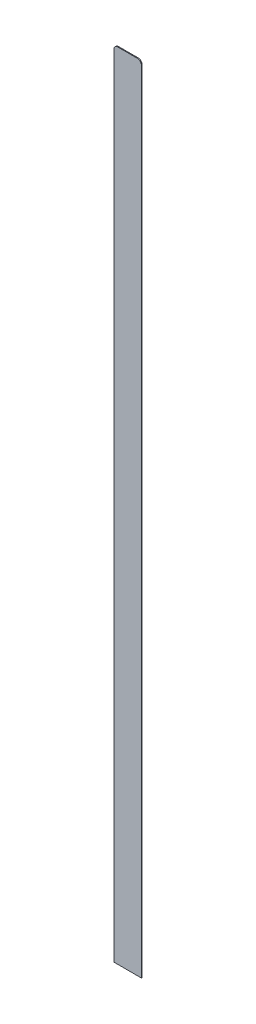
ISO-10303-21;
HEADER;
FILE_DESCRIPTION(('STEP AP214'),'2;1');
FILE_NAME('part.step','',(''),(''),'','','');
FILE_SCHEMA(('AUTOMOTIVE_DESIGN { 1 0 10303 214 1 1 1 1 }'));
ENDSEC;
DATA;
#1=APPLICATION_CONTEXT('core data for automotive mechanical design processes');
#2=APPLICATION_PROTOCOL_DEFINITION('international standard','automotive_design',2000,#1);
#3=PRODUCT_CONTEXT('',#1,'mechanical');
#4=PRODUCT('Part','Part','',(#3));
#5=PRODUCT_RELATED_PRODUCT_CATEGORY('part','',(#4));
#6=PRODUCT_DEFINITION_FORMATION('','',#4);
#7=PRODUCT_DEFINITION_CONTEXT('part definition',#1,'design');
#8=PRODUCT_DEFINITION('design','',#6,#7);
#9=PRODUCT_DEFINITION_SHAPE('','',#8);
#10=(LENGTH_UNIT() NAMED_UNIT(*) SI_UNIT(.MILLI.,.METRE.));
#11=(NAMED_UNIT(*) PLANE_ANGLE_UNIT() SI_UNIT($,.RADIAN.));
#12=(NAMED_UNIT(*) SI_UNIT($,.STERADIAN.) SOLID_ANGLE_UNIT());
#13=UNCERTAINTY_MEASURE_WITH_UNIT(LENGTH_MEASURE(1.E-05),#10,'distance_accuracy_value','');
#14=(GEOMETRIC_REPRESENTATION_CONTEXT(3) GLOBAL_UNCERTAINTY_ASSIGNED_CONTEXT((#13)) GLOBAL_UNIT_ASSIGNED_CONTEXT((#10,
#11,#12)) REPRESENTATION_CONTEXT('',''));
#15=CARTESIAN_POINT('',(0.,0.,0.));
#16=DIRECTION('',(0.,0.,1.));
#17=DIRECTION('',(1.,0.,0.));
#18=AXIS2_PLACEMENT_3D('',#15,#16,#17);
#19=CARTESIAN_POINT('',(0.,0.,1.));
#20=DIRECTION('',(1.,0.,0.));
#21=DIRECTION('',(0.,0.,-1.));
#22=AXIS2_PLACEMENT_3D('',#19,#20,#21);
#23=PLANE('',#22);
#24=DIRECTION('',(0.,-1.,0.));
#25=VECTOR('',#24,1.);
#26=CARTESIAN_POINT('',(0.,0.,1.));
#27=LINE('',#26,#25);
#28=CARTESIAN_POINT('',(0.,1005.,1.));
#29=VERTEX_POINT('',#28);
#30=CARTESIAN_POINT('',(0.,0.,1.));
#31=VERTEX_POINT('',#30);
#32=EDGE_CURVE('E86',#29,#31,#27,.T.);
#33=ORIENTED_EDGE('',*,*,#32,.F.);
#34=DIRECTION('',(0.,0.,-1.));
#35=VECTOR('',#34,1.);
#36=CARTESIAN_POINT('',(0.,1005.,1.));
#37=LINE('',#36,#35);
#38=CARTESIAN_POINT('',(0.,1005.,0.));
#39=VERTEX_POINT('',#38);
#40=EDGE_CURVE('E11',#29,#39,#37,.T.);
#41=ORIENTED_EDGE('',*,*,#40,.T.);
#42=DIRECTION('',(0.,-1.,0.));
#43=VECTOR('',#42,1.);
#44=CARTESIAN_POINT('',(0.,0.,0.));
#45=LINE('',#44,#43);
#46=CARTESIAN_POINT('',(0.,0.,0.));
#47=VERTEX_POINT('',#46);
#48=EDGE_CURVE('E105',#39,#47,#45,.T.);
#49=ORIENTED_EDGE('',*,*,#48,.T.);
#50=DIRECTION('',(0.,0.,-1.));
#51=VECTOR('',#50,1.);
#52=CARTESIAN_POINT('',(0.,0.,1.));
#53=LINE('',#52,#51);
#54=EDGE_CURVE('E99',#31,#47,#53,.T.);
#55=ORIENTED_EDGE('',*,*,#54,.F.);
#56=EDGE_LOOP('',(#33,#41,#49,#55));
#57=FACE_BOUND('',#56,.T.);
#58=ADVANCED_FACE('F33',(#57),#23,.F.);
#59=CARTESIAN_POINT('',(0.,0.,1.));
#60=DIRECTION('',(0.,1.,0.));
#61=DIRECTION('',(0.,0.,1.));
#62=AXIS2_PLACEMENT_3D('',#59,#60,#61);
#63=PLANE('',#62);
#64=DIRECTION('',(1.,0.,0.));
#65=VECTOR('',#64,1.);
#66=CARTESIAN_POINT('',(0.,0.,0.));
#67=LINE('',#66,#65);
#68=CARTESIAN_POINT('',(35.,0.,0.));
#69=VERTEX_POINT('',#68);
#70=EDGE_CURVE('E138',#47,#69,#67,.T.);
#71=ORIENTED_EDGE('',*,*,#70,.T.);
#72=DIRECTION('',(0.,0.,-1.));
#73=VECTOR('',#72,1.);
#74=CARTESIAN_POINT('',(35.,0.,1.));
#75=LINE('',#74,#73);
#76=CARTESIAN_POINT('',(35.,0.,1.));
#77=VERTEX_POINT('',#76);
#78=EDGE_CURVE('E101',#77,#69,#75,.T.);
#79=ORIENTED_EDGE('',*,*,#78,.F.);
#80=DIRECTION('',(1.,0.,0.));
#81=VECTOR('',#80,1.);
#82=CARTESIAN_POINT('',(0.,0.,1.));
#83=LINE('',#82,#81);
#84=EDGE_CURVE('E89',#31,#77,#83,.T.);
#85=ORIENTED_EDGE('',*,*,#84,.F.);
#86=ORIENTED_EDGE('',*,*,#54,.T.);
#87=EDGE_LOOP('',(#71,#79,#85,#86));
#88=FACE_BOUND('',#87,.T.);
#89=ADVANCED_FACE('F98',(#88),#63,.F.);
#90=CARTESIAN_POINT('',(35.,0.,1.));
#91=DIRECTION('',(-1.,0.,0.));
#92=DIRECTION('',(0.,0.,1.));
#93=AXIS2_PLACEMENT_3D('',#90,#91,#92);
#94=PLANE('',#93);
#95=DIRECTION('',(0.,1.,0.));
#96=VECTOR('',#95,1.);
#97=CARTESIAN_POINT('',(35.,0.,0.));
#98=LINE('',#97,#96);
#99=CARTESIAN_POINT('',(35.,1005.,0.));
#100=VERTEX_POINT('',#99);
#101=EDGE_CURVE('E136',#69,#100,#98,.T.);
#102=ORIENTED_EDGE('',*,*,#101,.T.);
#103=DIRECTION('',(0.,0.,-1.));
#104=VECTOR('',#103,1.);
#105=CARTESIAN_POINT('',(35.,1005.,1.));
#106=LINE('',#105,#104);
#107=CARTESIAN_POINT('',(35.,1005.,1.));
#108=VERTEX_POINT('',#107);
#109=EDGE_CURVE('E56',#100,#108,#106,.F.);
#110=ORIENTED_EDGE('',*,*,#109,.T.);
#111=DIRECTION('',(0.,1.,0.));
#112=VECTOR('',#111,1.);
#113=CARTESIAN_POINT('',(35.,0.,1.));
#114=LINE('',#113,#112);
#115=EDGE_CURVE('E102',#77,#108,#114,.T.);
#116=ORIENTED_EDGE('',*,*,#115,.F.);
#117=ORIENTED_EDGE('',*,*,#78,.T.);
#118=EDGE_LOOP('',(#102,#110,#116,#117));
#119=FACE_BOUND('',#118,.T.);
#120=ADVANCED_FACE('F137',(#119),#94,.F.);
#121=CARTESIAN_POINT('',(0.,1010.,1.));
#122=DIRECTION('',(0.,-1.,0.));
#123=DIRECTION('',(0.,0.,-1.));
#124=AXIS2_PLACEMENT_3D('',#121,#122,#123);
#125=PLANE('',#124);
#126=DIRECTION('',(-1.,0.,0.));
#127=VECTOR('',#126,1.);
#128=CARTESIAN_POINT('',(0.,1010.,1.));
#129=LINE('',#128,#127);
#130=CARTESIAN_POINT('',(30.,1010.,1.));
#131=VERTEX_POINT('',#130);
#132=CARTESIAN_POINT('',(5.,1010.,1.));
#133=VERTEX_POINT('',#132);
#134=EDGE_CURVE('E111',#131,#133,#129,.T.);
#135=ORIENTED_EDGE('',*,*,#134,.F.);
#136=DIRECTION('',(0.,0.,-1.));
#137=VECTOR('',#136,1.);
#138=CARTESIAN_POINT('',(30.,1010.,1.));
#139=LINE('',#138,#137);
#140=CARTESIAN_POINT('',(30.,1010.,0.));
#141=VERTEX_POINT('',#140);
#142=EDGE_CURVE('E109',#131,#141,#139,.T.);
#143=ORIENTED_EDGE('',*,*,#142,.T.);
#144=DIRECTION('',(-1.,0.,0.));
#145=VECTOR('',#144,1.);
#146=CARTESIAN_POINT('',(0.,1010.,0.));
#147=LINE('',#146,#145);
#148=CARTESIAN_POINT('',(5.,1010.,0.));
#149=VERTEX_POINT('',#148);
#150=EDGE_CURVE('E94',#141,#149,#147,.T.);
#151=ORIENTED_EDGE('',*,*,#150,.T.);
#152=DIRECTION('',(0.,0.,-1.));
#153=VECTOR('',#152,1.);
#154=CARTESIAN_POINT('',(5.,1010.,1.));
#155=LINE('',#154,#153);
#156=EDGE_CURVE('E107',#149,#133,#155,.F.);
#157=ORIENTED_EDGE('',*,*,#156,.T.);
#158=EDGE_LOOP('',(#135,#143,#151,#157));
#159=FACE_BOUND('',#158,.T.);
#160=ADVANCED_FACE('F127',(#159),#125,.F.);
#161=CARTESIAN_POINT('',(0.,0.,1.));
#162=DIRECTION('',(0.,0.,-1.));
#163=DIRECTION('',(-1.,0.,0.));
#164=AXIS2_PLACEMENT_3D('',#161,#162,#163);
#165=PLANE('',#164);
#166=ORIENTED_EDGE('',*,*,#115,.T.);
#167=CARTESIAN_POINT('',(30.,1005.,1.));
#168=DIRECTION('',(0.,0.,-1.));
#169=DIRECTION('',(-1.,0.,0.));
#170=AXIS2_PLACEMENT_3D('',#167,#168,#169);
#171=CIRCLE('',#170,5.);
#172=EDGE_CURVE('E41',#108,#131,#171,.F.);
#173=ORIENTED_EDGE('',*,*,#172,.T.);
#174=ORIENTED_EDGE('',*,*,#134,.T.);
#175=CARTESIAN_POINT('',(5.,1005.,1.));
#176=DIRECTION('',(0.,0.,-1.));
#177=DIRECTION('',(-1.,0.,0.));
#178=AXIS2_PLACEMENT_3D('',#175,#176,#177);
#179=CIRCLE('',#178,5.);
#180=EDGE_CURVE('E48',#133,#29,#179,.F.);
#181=ORIENTED_EDGE('',*,*,#180,.T.);
#182=ORIENTED_EDGE('',*,*,#32,.T.);
#183=ORIENTED_EDGE('',*,*,#84,.T.);
#184=EDGE_LOOP('',(#166,#173,#174,#181,#182,#183));
#185=FACE_BOUND('',#184,.T.);
#186=ADVANCED_FACE('F88',(#185),#165,.F.);
#187=CARTESIAN_POINT('',(0.,0.,0.));
#188=DIRECTION('',(0.,0.,-1.));
#189=DIRECTION('',(-1.,0.,0.));
#190=AXIS2_PLACEMENT_3D('',#187,#188,#189);
#191=PLANE('',#190);
#192=ORIENTED_EDGE('',*,*,#150,.F.);
#193=CARTESIAN_POINT('',(30.,1005.,0.));
#194=DIRECTION('',(0.,0.,-1.));
#195=DIRECTION('',(-1.,0.,0.));
#196=AXIS2_PLACEMENT_3D('',#193,#194,#195);
#197=CIRCLE('',#196,5.);
#198=EDGE_CURVE('E119',#141,#100,#197,.T.);
#199=ORIENTED_EDGE('',*,*,#198,.T.);
#200=ORIENTED_EDGE('',*,*,#101,.F.);
#201=ORIENTED_EDGE('',*,*,#70,.F.);
#202=ORIENTED_EDGE('',*,*,#48,.F.);
#203=CARTESIAN_POINT('',(5.,1005.,0.));
#204=DIRECTION('',(0.,0.,-1.));
#205=DIRECTION('',(-1.,0.,0.));
#206=AXIS2_PLACEMENT_3D('',#203,#204,#205);
#207=CIRCLE('',#206,5.);
#208=EDGE_CURVE('E117',#39,#149,#207,.T.);
#209=ORIENTED_EDGE('',*,*,#208,.T.);
#210=EDGE_LOOP('',(#192,#199,#200,#201,#202,#209));
#211=FACE_BOUND('',#210,.T.);
#212=ADVANCED_FACE('F135',(#211),#191,.T.);
#213=CARTESIAN_POINT('',(30.,1005.,1.));
#214=DIRECTION('',(0.,0.,-1.));
#215=DIRECTION('',(-1.,0.,0.));
#216=AXIS2_PLACEMENT_3D('',#213,#214,#215);
#217=CYLINDRICAL_SURFACE('',#216,5.);
#218=ORIENTED_EDGE('',*,*,#172,.F.);
#219=ORIENTED_EDGE('',*,*,#109,.F.);
#220=ORIENTED_EDGE('',*,*,#198,.F.);
#221=ORIENTED_EDGE('',*,*,#142,.F.);
#222=EDGE_LOOP('',(#218,#219,#220,#221));
#223=FACE_BOUND('',#222,.T.);
#224=ADVANCED_FACE('F132',(#223),#217,.T.);
#225=CARTESIAN_POINT('',(5.,1005.,1.));
#226=DIRECTION('',(0.,0.,-1.));
#227=DIRECTION('',(-1.,0.,0.));
#228=AXIS2_PLACEMENT_3D('',#225,#226,#227);
#229=CYLINDRICAL_SURFACE('',#228,5.);
#230=ORIENTED_EDGE('',*,*,#180,.F.);
#231=ORIENTED_EDGE('',*,*,#156,.F.);
#232=ORIENTED_EDGE('',*,*,#208,.F.);
#233=ORIENTED_EDGE('',*,*,#40,.F.);
#234=EDGE_LOOP('',(#230,#231,#232,#233));
#235=FACE_BOUND('',#234,.T.);
#236=ADVANCED_FACE('F35',(#235),#229,.T.);
#237=CLOSED_SHELL('',(#58,#89,#120,#160,#186,#212,#224,#236));
#238=MANIFOLD_SOLID_BREP('B2',#237);
#239=ADVANCED_BREP_SHAPE_REPRESENTATION('',(#18,#238),#14);
#240=SHAPE_DEFINITION_REPRESENTATION(#9,#239);
ENDSEC;
END-ISO-10303-21;
